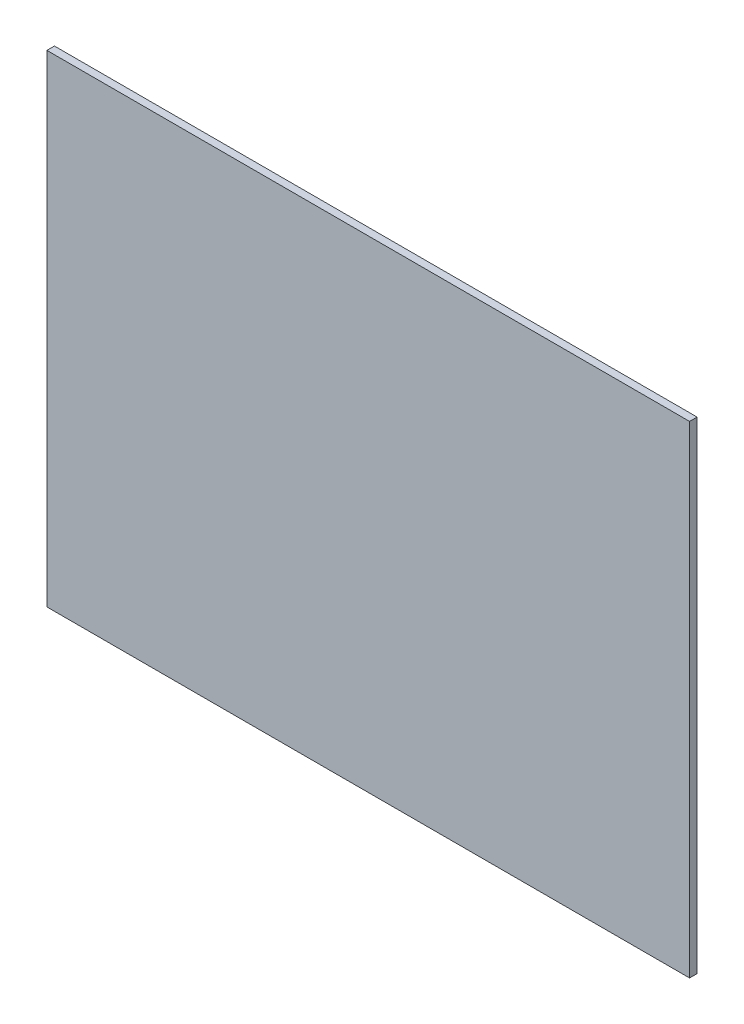
ISO-10303-21;
HEADER;
FILE_DESCRIPTION(('STEP AP214'),'2;1');
FILE_NAME('part.step','',(''),(''),'','','');
FILE_SCHEMA(('AUTOMOTIVE_DESIGN { 1 0 10303 214 1 1 1 1 }'));
ENDSEC;
DATA;
#1=APPLICATION_CONTEXT('core data for automotive mechanical design processes');
#2=APPLICATION_PROTOCOL_DEFINITION('international standard','automotive_design',2000,#1);
#3=PRODUCT_CONTEXT('',#1,'mechanical');
#4=PRODUCT('Part','Part','',(#3));
#5=PRODUCT_RELATED_PRODUCT_CATEGORY('part','',(#4));
#6=PRODUCT_DEFINITION_FORMATION('','',#4);
#7=PRODUCT_DEFINITION_CONTEXT('part definition',#1,'design');
#8=PRODUCT_DEFINITION('design','',#6,#7);
#9=PRODUCT_DEFINITION_SHAPE('','',#8);
#10=(LENGTH_UNIT() NAMED_UNIT(*) SI_UNIT(.MILLI.,.METRE.));
#11=(NAMED_UNIT(*) PLANE_ANGLE_UNIT() SI_UNIT($,.RADIAN.));
#12=(NAMED_UNIT(*) SI_UNIT($,.STERADIAN.) SOLID_ANGLE_UNIT());
#13=UNCERTAINTY_MEASURE_WITH_UNIT(LENGTH_MEASURE(1.E-05),#10,'distance_accuracy_value','');
#14=(GEOMETRIC_REPRESENTATION_CONTEXT(3) GLOBAL_UNCERTAINTY_ASSIGNED_CONTEXT((#13)) GLOBAL_UNIT_ASSIGNED_CONTEXT((#10,
#11,#12)) REPRESENTATION_CONTEXT('',''));
#15=CARTESIAN_POINT('',(0.,0.,0.));
#16=DIRECTION('',(0.,0.,1.));
#17=DIRECTION('',(1.,0.,0.));
#18=AXIS2_PLACEMENT_3D('',#15,#16,#17);
#19=CARTESIAN_POINT('',(0.,304.8,4.7625));
#20=DIRECTION('',(1.,0.,0.));
#21=DIRECTION('',(0.,0.,-1.));
#22=AXIS2_PLACEMENT_3D('',#19,#20,#21);
#23=PLANE('',#22);
#24=DIRECTION('',(0.,-1.,0.));
#25=VECTOR('',#24,1.);
#26=CARTESIAN_POINT('',(0.,304.8,0.));
#27=LINE('',#26,#25);
#28=CARTESIAN_POINT('',(0.,304.8,0.));
#29=VERTEX_POINT('',#28);
#30=CARTESIAN_POINT('',(0.,0.,0.));
#31=VERTEX_POINT('',#30);
#32=EDGE_CURVE('E96',#29,#31,#27,.T.);
#33=ORIENTED_EDGE('',*,*,#32,.T.);
#34=DIRECTION('',(0.,0.,-1.));
#35=VECTOR('',#34,1.);
#36=CARTESIAN_POINT('',(0.,0.,4.7625));
#37=LINE('',#36,#35);
#38=CARTESIAN_POINT('',(0.,0.,4.7625));
#39=VERTEX_POINT('',#38);
#40=EDGE_CURVE('E11',#39,#31,#37,.T.);
#41=ORIENTED_EDGE('',*,*,#40,.F.);
#42=DIRECTION('',(0.,-1.,0.));
#43=VECTOR('',#42,1.);
#44=CARTESIAN_POINT('',(0.,304.8,4.7625));
#45=LINE('',#44,#43);
#46=CARTESIAN_POINT('',(0.,304.8,4.7625));
#47=VERTEX_POINT('',#46);
#48=EDGE_CURVE('E84',#47,#39,#45,.T.);
#49=ORIENTED_EDGE('',*,*,#48,.F.);
#50=DIRECTION('',(0.,0.,-1.));
#51=VECTOR('',#50,1.);
#52=CARTESIAN_POINT('',(0.,304.8,4.7625));
#53=LINE('',#52,#51);
#54=EDGE_CURVE('E92',#47,#29,#53,.T.);
#55=ORIENTED_EDGE('',*,*,#54,.T.);
#56=EDGE_LOOP('',(#33,#41,#49,#55));
#57=FACE_BOUND('',#56,.T.);
#58=ADVANCED_FACE('F33',(#57),#23,.F.);
#59=CARTESIAN_POINT('',(0.,0.,4.7625));
#60=DIRECTION('',(0.,1.,0.));
#61=DIRECTION('',(0.,0.,1.));
#62=AXIS2_PLACEMENT_3D('',#59,#60,#61);
#63=PLANE('',#62);
#64=DIRECTION('',(1.,0.,0.));
#65=VECTOR('',#64,1.);
#66=CARTESIAN_POINT('',(0.,0.,0.));
#67=LINE('',#66,#65);
#68=CARTESIAN_POINT('',(406.4,0.,0.));
#69=VERTEX_POINT('',#68);
#70=EDGE_CURVE('E88',#31,#69,#67,.T.);
#71=ORIENTED_EDGE('',*,*,#70,.T.);
#72=DIRECTION('',(0.,0.,-1.));
#73=VECTOR('',#72,1.);
#74=CARTESIAN_POINT('',(406.4,0.,4.7625));
#75=LINE('',#74,#73);
#76=CARTESIAN_POINT('',(406.4,0.,4.7625));
#77=VERTEX_POINT('',#76);
#78=EDGE_CURVE('E41',#77,#69,#75,.T.);
#79=ORIENTED_EDGE('',*,*,#78,.F.);
#80=DIRECTION('',(1.,0.,0.));
#81=VECTOR('',#80,1.);
#82=CARTESIAN_POINT('',(0.,0.,4.7625));
#83=LINE('',#82,#81);
#84=EDGE_CURVE('E79',#39,#77,#83,.T.);
#85=ORIENTED_EDGE('',*,*,#84,.F.);
#86=ORIENTED_EDGE('',*,*,#40,.T.);
#87=EDGE_LOOP('',(#71,#79,#85,#86));
#88=FACE_BOUND('',#87,.T.);
#89=ADVANCED_FACE('F87',(#88),#63,.F.);
#90=CARTESIAN_POINT('',(406.4,304.8,4.7625));
#91=DIRECTION('',(-1.,0.,0.));
#92=DIRECTION('',(0.,-1.,0.));
#93=AXIS2_PLACEMENT_3D('',#90,#91,#92);
#94=PLANE('',#93);
#95=DIRECTION('',(0.,1.,0.));
#96=VECTOR('',#95,1.);
#97=CARTESIAN_POINT('',(406.4,304.8,0.));
#98=LINE('',#97,#96);
#99=CARTESIAN_POINT('',(406.4,304.8,0.));
#100=VERTEX_POINT('',#99);
#101=EDGE_CURVE('E66',#69,#100,#98,.T.);
#102=ORIENTED_EDGE('',*,*,#101,.T.);
#103=DIRECTION('',(0.,0.,-1.));
#104=VECTOR('',#103,1.);
#105=CARTESIAN_POINT('',(406.4,304.8,4.7625));
#106=LINE('',#105,#104);
#107=CARTESIAN_POINT('',(406.4,304.8,4.7625));
#108=VERTEX_POINT('',#107);
#109=EDGE_CURVE('E89',#108,#100,#106,.T.);
#110=ORIENTED_EDGE('',*,*,#109,.F.);
#111=DIRECTION('',(0.,1.,0.));
#112=VECTOR('',#111,1.);
#113=CARTESIAN_POINT('',(406.4,304.8,4.7625));
#114=LINE('',#113,#112);
#115=EDGE_CURVE('E82',#77,#108,#114,.T.);
#116=ORIENTED_EDGE('',*,*,#115,.F.);
#117=ORIENTED_EDGE('',*,*,#78,.T.);
#118=EDGE_LOOP('',(#102,#110,#116,#117));
#119=FACE_BOUND('',#118,.T.);
#120=ADVANCED_FACE('F90',(#119),#94,.F.);
#121=CARTESIAN_POINT('',(0.,304.8,4.7625));
#122=DIRECTION('',(0.,-1.,0.));
#123=DIRECTION('',(0.,0.,-1.));
#124=AXIS2_PLACEMENT_3D('',#121,#122,#123);
#125=PLANE('',#124);
#126=DIRECTION('',(-1.,0.,0.));
#127=VECTOR('',#126,1.);
#128=CARTESIAN_POINT('',(0.,304.8,0.));
#129=LINE('',#128,#127);
#130=EDGE_CURVE('E72',#100,#29,#129,.T.);
#131=ORIENTED_EDGE('',*,*,#130,.T.);
#132=ORIENTED_EDGE('',*,*,#54,.F.);
#133=DIRECTION('',(-1.,0.,0.));
#134=VECTOR('',#133,1.);
#135=CARTESIAN_POINT('',(0.,304.8,4.7625));
#136=LINE('',#135,#134);
#137=EDGE_CURVE('E49',#108,#47,#136,.T.);
#138=ORIENTED_EDGE('',*,*,#137,.F.);
#139=ORIENTED_EDGE('',*,*,#109,.T.);
#140=EDGE_LOOP('',(#131,#132,#138,#139));
#141=FACE_BOUND('',#140,.T.);
#142=ADVANCED_FACE('F103',(#141),#125,.F.);
#143=CARTESIAN_POINT('',(0.,0.,4.7625));
#144=DIRECTION('',(0.,0.,1.));
#145=DIRECTION('',(1.,0.,0.));
#146=AXIS2_PLACEMENT_3D('',#143,#144,#145);
#147=PLANE('',#146);
#148=ORIENTED_EDGE('',*,*,#48,.T.);
#149=ORIENTED_EDGE('',*,*,#84,.T.);
#150=ORIENTED_EDGE('',*,*,#115,.T.);
#151=ORIENTED_EDGE('',*,*,#137,.T.);
#152=EDGE_LOOP('',(#148,#149,#150,#151));
#153=FACE_BOUND('',#152,.T.);
#154=ADVANCED_FACE('F80',(#153),#147,.T.);
#155=CARTESIAN_POINT('',(0.,0.,0.));
#156=DIRECTION('',(0.,0.,1.));
#157=DIRECTION('',(1.,0.,0.));
#158=AXIS2_PLACEMENT_3D('',#155,#156,#157);
#159=PLANE('',#158);
#160=ORIENTED_EDGE('',*,*,#32,.F.);
#161=ORIENTED_EDGE('',*,*,#130,.F.);
#162=ORIENTED_EDGE('',*,*,#101,.F.);
#163=ORIENTED_EDGE('',*,*,#70,.F.);
#164=EDGE_LOOP('',(#160,#161,#162,#163));
#165=FACE_BOUND('',#164,.T.);
#166=ADVANCED_FACE('F106',(#165),#159,.F.);
#167=CLOSED_SHELL('',(#58,#89,#120,#142,#154,#166));
#168=MANIFOLD_SOLID_BREP('B2',#167);
#169=ADVANCED_BREP_SHAPE_REPRESENTATION('',(#18,#168),#14);
#170=SHAPE_DEFINITION_REPRESENTATION(#9,#169);
ENDSEC;
END-ISO-10303-21;
